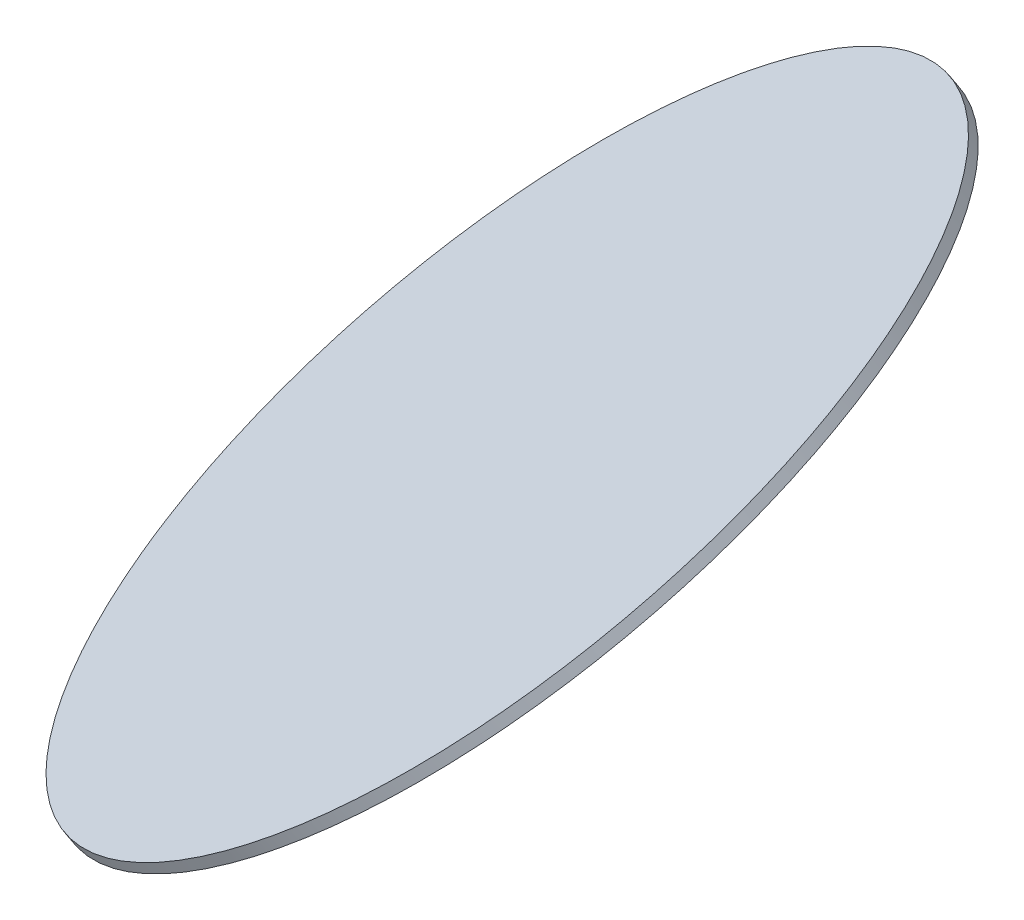
ISO-10303-21;
HEADER;
FILE_DESCRIPTION(('STEP AP214'),'2;1');
FILE_NAME('part.step','',(''),(''),'','','');
FILE_SCHEMA(('AUTOMOTIVE_DESIGN { 1 0 10303 214 1 1 1 1 }'));
ENDSEC;
DATA;
#1=APPLICATION_CONTEXT('core data for automotive mechanical design processes');
#2=APPLICATION_PROTOCOL_DEFINITION('international standard','automotive_design',2000,#1);
#3=PRODUCT_CONTEXT('',#1,'mechanical');
#4=PRODUCT('Part','Part','',(#3));
#5=PRODUCT_RELATED_PRODUCT_CATEGORY('part','',(#4));
#6=PRODUCT_DEFINITION_FORMATION('','',#4);
#7=PRODUCT_DEFINITION_CONTEXT('part definition',#1,'design');
#8=PRODUCT_DEFINITION('design','',#6,#7);
#9=PRODUCT_DEFINITION_SHAPE('','',#8);
#10=(LENGTH_UNIT() NAMED_UNIT(*) SI_UNIT(.MILLI.,.METRE.));
#11=(NAMED_UNIT(*) PLANE_ANGLE_UNIT() SI_UNIT($,.RADIAN.));
#12=(NAMED_UNIT(*) SI_UNIT($,.STERADIAN.) SOLID_ANGLE_UNIT());
#13=UNCERTAINTY_MEASURE_WITH_UNIT(LENGTH_MEASURE(1.E-05),#10,'distance_accuracy_value','');
#14=(GEOMETRIC_REPRESENTATION_CONTEXT(3) GLOBAL_UNCERTAINTY_ASSIGNED_CONTEXT((#13)) GLOBAL_UNIT_ASSIGNED_CONTEXT((#10,
#11,#12)) REPRESENTATION_CONTEXT('',''));
#15=CARTESIAN_POINT('',(0.,0.,0.));
#16=DIRECTION('',(0.,0.,1.));
#17=DIRECTION('',(1.,0.,0.));
#18=AXIS2_PLACEMENT_3D('',#15,#16,#17);
#19=CARTESIAN_POINT('',(-421.834970696077,260.326829567826,319.301786028271));
#20=CARTESIAN_POINT('',(-423.425436477836,262.704158960366,311.390337922479));
#21=CARTESIAN_POINT('',(-425.919363900651,267.918432883821,295.567441710896));
#22=CARTESIAN_POINT('',(-427.563215786157,277.043364721689,272.061672103809));
#23=CARTESIAN_POINT('',(-427.094197230668,287.383939430452,249.010850617888));
#24=CARTESIAN_POINT('',(-424.516825139266,298.840571622928,226.636969264903));
#25=CARTESIAN_POINT('',(-419.855921014126,311.302927668273,205.15550075309));
#26=CARTESIAN_POINT('',(-413.156371909882,324.650988265153,184.773323367185));
#27=CARTESIAN_POINT('',(-404.482698146754,338.756204293228,165.686728617444));
#28=CARTESIAN_POINT('',(-393.918431944594,353.482734811453,148.079530845101));
#29=CARTESIAN_POINT('',(-381.565312961943,368.688755280595,132.121296989779));
#30=CARTESIAN_POINT('',(-367.542308487507,384.227823411082,117.96571356716));
#31=CARTESIAN_POINT('',(-351.984467720128,399.950289482298,105.749106583835));
#32=CARTESIAN_POINT('',(-335.041621171177,415.704737551203,95.5891286433293));
#33=CARTESIAN_POINT('',(-316.876937714822,431.339443670635,87.5836258872187));
#34=CARTESIAN_POINT('',(-297.665353182574,446.703837073865,81.809695683298));
#35=CARTESIAN_POINT('',(-277.591885635599,461.649950253389,78.3229441357821));
#36=CARTESIAN_POINT('',(-256.849853539648,476.03384396891,77.1569505681254));
#37=CARTESIAN_POINT('',(-235.639014002554,489.716993460912,78.3229441357819));
#38=CARTESIAN_POINT('',(-214.163639004081,502.567622519817,81.809695683298));
#39=CARTESIAN_POINT('',(-192.630548145101,514.461972562919,87.5836258872188));
#40=CARTESIAN_POINT('',(-171.24711686177,525.28549449719,95.5891286433292));
#41=CARTESIAN_POINT('',(-150.219279286719,534.933951889664,105.749106583835));
#42=CARTESIAN_POINT('',(-129.749544990781,543.314424821267,117.96571356716));
#43=CARTESIAN_POINT('',(-110.035048705121,550.346204756438,132.121296989779));
#44=CARTESIAN_POINT('',(-91.2656518060091,555.961571810436,148.079530845101));
#45=CARTESIAN_POINT('',(-73.6221138459808,560.106446928862,165.686728617444));
#46=CARTESIAN_POINT('',(-57.2743517405296,562.740912698504,184.773323367185));
#47=CARTESIAN_POINT('',(-42.3798033753273,563.839597773857,205.15550075309));
#48=CARTESIAN_POINT('',(-29.0819113933184,563.391921217041,226.636969264903));
#49=CARTESIAN_POINT('',(-17.5087417636575,561.402194398024,249.010850617888));
#50=CARTESIAN_POINT('',(-7.77175043641579,557.889579473768,272.061672103809));
#51=CARTESIAN_POINT('',(0.0352900391439792,552.887904846185,295.567441710896));
#52=CARTESIAN_POINT('',(5.83719359548026,546.445339376132,319.301786028271));
#53=CARTESIAN_POINT('',(9.57808472970202,538.62392849095,343.036130345647));
#54=CARTESIAN_POINT('',(11.2219366152078,529.498996653081,366.541899952733));
#55=CARTESIAN_POINT('',(10.7529180597191,519.158421944318,389.592721438654));
#56=CARTESIAN_POINT('',(8.17554596831734,507.701789751843,411.966602791639));
#57=CARTESIAN_POINT('',(3.51464184317708,495.239433706497,433.448071303452));
#58=CARTESIAN_POINT('',(-3.18490726106665,481.891373109617,453.830248689357));
#59=CARTESIAN_POINT('',(-11.8585810241946,467.786157081542,472.916843439099));
#60=CARTESIAN_POINT('',(-22.4228472263545,453.059626563318,490.524041211441));
#61=CARTESIAN_POINT('',(-34.7759662090054,437.853606094175,506.482275066764));
#62=CARTESIAN_POINT('',(-48.7989706834416,422.314537963688,520.637858489382));
#63=CARTESIAN_POINT('',(-64.3568114508207,406.592071892472,532.854465472707));
#64=CARTESIAN_POINT('',(-81.2996579997718,390.837623823568,543.014443413213));
#65=CARTESIAN_POINT('',(-99.4643414561268,375.202917704135,551.019946169323));
#66=CARTESIAN_POINT('',(-118.675925988375,359.838524300905,556.793876373244));
#67=CARTESIAN_POINT('',(-138.74939353535,344.892411121382,560.28062792076));
#68=CARTESIAN_POINT('',(-159.4914256313,330.508517405861,561.446621488417));
#69=CARTESIAN_POINT('',(-180.702265168395,316.825367913858,560.28062792076));
#70=CARTESIAN_POINT('',(-202.177640166867,303.974738854953,556.793876373244));
#71=CARTESIAN_POINT('',(-223.710731025847,292.080388811851,551.019946169323));
#72=CARTESIAN_POINT('',(-245.094162309179,281.25686687758,543.014443413213));
#73=CARTESIAN_POINT('',(-266.12199988423,271.608409485107,532.854465472707));
#74=CARTESIAN_POINT('',(-286.591734180168,263.227936553503,520.637858489382));
#75=CARTESIAN_POINT('',(-306.306230465828,256.196156618333,506.482275066764));
#76=CARTESIAN_POINT('',(-325.07562736494,250.580789564334,490.524041211441));
#77=CARTESIAN_POINT('',(-342.719165324968,246.435914445909,472.916843439099));
#78=CARTESIAN_POINT('',(-359.066927430419,243.801448676266,453.830248689357));
#79=CARTESIAN_POINT('',(-373.961475795621,242.702763600914,433.448071303452));
#80=CARTESIAN_POINT('',(-387.25936777763,243.15044015773,411.96660279164));
#81=CARTESIAN_POINT('',(-398.832537407291,245.140166976747,389.592721438655));
#82=CARTESIAN_POINT('',(-408.569528734533,248.652781901002,366.541899952733));
#83=CARTESIAN_POINT('',(-416.376569210093,253.654456528585,343.036130345647));
#84=CARTESIAN_POINT('',(-420.244504914317,257.949500175287,327.213234134063));
#85=CARTESIAN_POINT('',(-421.834970696077,260.326829567826,319.301786028271));
#86=B_SPLINE_CURVE_WITH_KNOTS('',3,(#19,#20,#21,#22,#23,#24,#25,#26,#27,#28,#29,#30,#31,#32,#33,
#34,#35,#36,#37,#38,#39,#40,#41,#42,#43,#44,#45,#46,#47,#48,#49,#50,#51,#52,#53,#54,#55,#56,#57,
#58,#59,#60,#61,#62,#63,#64,#65,#66,#67,#68,#69,#70,#71,#72,#73,#74,#75,#76,#77,#78,#79,#80,#81,
#82,#83,#84,#85),.UNSPECIFIED.,.T.,.F.,(4,1,1,1,1,1,1,1,1,1,1,1,1,1,1,1,1,1,1,1,1,1,1,1,1,1,1,1,
1,1,1,1,1,1,1,1,1,1,1,1,1,1,1,1,1,1,1,1,1,1,1,1,1,1,1,1,1,1,1,1,1,1,1,1,4),(0.,0.015625,0.03125,
0.046875,0.0625,0.078125,0.09375,0.109375,0.125,0.140625,0.15625,0.171875,0.1875,0.203125,
0.21875,0.234375,0.25,0.265625,0.28125,0.296875,0.3125,0.328125,0.34375,0.359375,0.375,0.390625,
0.40625,0.421875,0.4375,0.453125,0.46875,0.484375,0.5,0.515625,0.53125,0.546875,0.5625,0.578125,
0.59375,0.609375,0.625,0.640625,0.65625,0.671875,0.6875,0.703125,0.71875,0.734375,0.75,0.765625,
0.78125,0.796875,0.8125,0.828125,0.84375,0.859375,0.875,0.890625,0.90625,0.921875,0.9375,
0.953125,0.96875,0.984375,1.),.UNSPECIFIED.);
#87=DIRECTION('',(-0.522923504454294,0.781633551281699,0.34));
#88=VECTOR('',#87,1.);
#89=SURFACE_OF_LINEAR_EXTRUSION('',#86,#88);
#90=CARTESIAN_POINT('',(-421.834970696077,260.326829567826,319.301786028271));
#91=CARTESIAN_POINT('',(-421.039737805197,259.138164871557,323.257510081167));
#92=CARTESIAN_POINT('',(-420.158629396729,258.006952067584,327.213234134063));
#93=CARTESIAN_POINT('',(-418.22698969057,255.862015470372,335.115158293593));
#94=CARTESIAN_POINT('',(-417.17645839288,254.848291677133,339.061358400227));
#95=CARTESIAN_POINT('',(-414.908301054231,252.940918327527,346.934710720971));
#96=CARTESIAN_POINT('',(-413.690675013272,252.04726877116,350.86186293508));
#97=CARTESIAN_POINT('',(-411.091460940899,250.382050931168,358.687687245323));
#98=CARTESIAN_POINT('',(-409.709872909486,249.610482647543,362.586359341455));
#99=CARTESIAN_POINT('',(-406.785867609019,248.191434388903,370.34579119029));
#100=CARTESIAN_POINT('',(-405.243450339966,247.543954413889,374.206550942992));
#101=CARTESIAN_POINT('',(-402.001693753771,246.374492289217,381.880908437809));
#102=CARTESIAN_POINT('',(-400.30235443663,245.852510139559,385.694506179923));
#103=CARTESIAN_POINT('',(-396.750660943813,244.935453182347,393.265289986408));
#104=CARTESIAN_POINT('',(-394.898306768137,244.540378374793,397.022476050778));
#105=CARTESIAN_POINT('',(-391.045227556169,243.877934524994,404.471458472263));
#106=CARTESIAN_POINT('',(-389.044502519878,243.610565482749,408.163254829378));
#107=CARTESIAN_POINT('',(-384.8993255846,243.204331586777,415.472479806844));
#108=CARTESIAN_POINT('',(-382.754873685613,243.065466733049,419.089908427195));
#109=CARTESIAN_POINT('',(-378.327579106991,242.916420854526,426.241778002602));
#110=CARTESIAN_POINT('',(-376.044736427357,242.90623982973,429.776218957658));
#111=CARTESIAN_POINT('',(-371.345996369488,243.014741249487,436.753493273944));
#112=CARTESIAN_POINT('',(-368.930098991254,243.133423694038,440.196326635175));
#113=CARTESIAN_POINT('',(-363.971226312976,243.499211180077,446.982206950882));
#114=CARTESIAN_POINT('',(-361.428251012932,243.746316221565,450.32525390536));
#115=CARTESIAN_POINT('',(-356.221199267823,244.368508029064,456.903382594634));
#116=CARTESIAN_POINT('',(-353.557122822758,244.743594795076,460.138464329431));
#117=CARTESIAN_POINT('',(-348.114428699511,245.620692912227,466.49300364846));
#118=CARTESIAN_POINT('',(-345.335811021328,246.122704263367,469.612461232692));
#119=CARTESIAN_POINT('',(-339.670594343748,247.252594411378,475.728093319706));
#120=CARTESIAN_POINT('',(-336.783995344351,247.88047320825,478.724267822488));
#121=CARTESIAN_POINT('',(-330.90989589582,249.260435022174,484.586268457451));
#122=CARTESIAN_POINT('',(-327.922395446687,250.012518039227,487.452094589632));
#123=CARTESIAN_POINT('',(-321.853572970164,251.639225067965,493.046333194243));
#124=CARTESIAN_POINT('',(-318.772250942774,252.513849079649,495.774745666673));
#125=CARTESIAN_POINT('',(-312.523316957759,254.383384803715,501.08775334696));
#126=CARTESIAN_POINT('',(-309.355705000134,255.378296516097,503.672348554818));
#127=CARTESIAN_POINT('',(-302.941722802672,257.486154347625,508.691318101142));
#128=CARTESIAN_POINT('',(-299.695352562835,258.599100466771,511.125692439607));
#129=CARTESIAN_POINT('',(-293.131764691626,260.940205449964,515.838539996872));
#130=CARTESIAN_POINT('',(-289.814547060255,262.16836431401,518.117013215671));
#131=CARTESIAN_POINT('',(-283.117175296655,264.737073125139,522.512378283329));
#132=CARTESIAN_POINT('',(-279.737021164427,266.077623072222,524.629270132187));
#133=CARTESIAN_POINT('',(-272.921990346246,268.867751193775,528.696570268148));
#134=CARTESIAN_POINT('',(-269.487113660293,270.317329368245,530.646978555252));
#135=CARTESIAN_POINT('',(-262.570851681795,273.322151088925,534.37640937589));
#136=CARTESIAN_POINT('',(-259.089466389249,274.877394635134,536.155431909425));
#137=CARTESIAN_POINT('',(-252.08862509635,278.089675435997,539.538014300362));
#138=CARTESIAN_POINT('',(-248.569169095997,279.746712690651,541.141574157763));
#139=CARTESIAN_POINT('',(-241.500624286266,283.158709245109,544.169154273865));
#140=CARTESIAN_POINT('',(-237.95153547689,284.913668544912,545.593174532567));
#141=CARTESIAN_POINT('',(-230.832305637972,288.517166004962,548.258463060945));
#142=CARTESIAN_POINT('',(-227.262164608432,290.365704165209,549.499731330623));
#143=CARTESIAN_POINT('',(-220.109410918046,294.152016161438,551.796303490628));
#144=CARTESIAN_POINT('',(-216.526798257202,296.08978999742,552.851607380956));
#145=CARTESIAN_POINT('',(-209.357741947382,300.049800466245,554.773933861254));
#146=CARTESIAN_POINT('',(-205.771298298406,302.072037099087,555.640956451224));
#147=CARTESIAN_POINT('',(-198.603220655497,306.196200282754,557.184403409797));
#148=CARTESIAN_POINT('',(-195.021586661564,308.29812683358,557.8608277784));
#149=CARTESIAN_POINT('',(-187.87174581211,312.576513245602,559.021679155761));
#150=CARTESIAN_POINT('',(-184.303538956589,314.752973106799,559.506106164519));
#151=CARTESIAN_POINT('',(-177.189169867327,319.17526953195,560.281563683715));
#152=CARTESIAN_POINT('',(-173.643007633588,321.421106095905,560.572594194152));
#153=CARTESIAN_POINT('',(-166.58123912038,325.976665251173,560.960790835227));
#154=CARTESIAN_POINT('',(-163.065632840911,328.286387842487,561.057956965865));
#155=CARTESIAN_POINT('',(-156.073487568737,332.964228377074,561.057956965865));
#156=CARTESIAN_POINT('',(-152.596948576031,335.332346320348,560.960790835227));
#157=CARTESIAN_POINT('',(-145.691261090207,340.121205693875,560.572594194152));
#158=CARTESIAN_POINT('',(-142.262112597089,342.541947124129,560.281563683715));
#159=CARTESIAN_POINT('',(-135.459529323268,347.430281606636,559.506106164519));
#160=CARTESIAN_POINT('',(-132.086094542565,349.89787465889,559.021679155761));
#161=CARTESIAN_POINT('',(-125.402993629647,354.873914917052,557.860827778399));
#162=CARTESIAN_POINT('',(-122.093327497431,357.38236212296,557.184403409797));
#163=CARTESIAN_POINT('',(-115.545818817561,362.434113220086,555.640956451224));
#164=CARTESIAN_POINT('',(-112.307976269906,364.977417111303,554.773933861254));
#165=CARTESIAN_POINT('',(-105.911823845038,370.092716266234,552.851607380956));
#166=CARTESIAN_POINT('',(-102.753513967826,372.664711529947,551.796303490628));
#167=CARTESIAN_POINT('',(-96.5241359697254,377.831228117058,549.499731330623));
#168=CARTESIAN_POINT('',(-93.4530678488373,380.425749440455,548.258463060945));
#169=CARTESIAN_POINT('',(-87.4054623563653,385.631044364985,545.593174532567));
#170=CARTESIAN_POINT('',(-84.4289249847813,388.241817966118,544.169154273865));
#171=CARTESIAN_POINT('',(-78.5776699838969,393.473343664175,541.141574157762));
#172=CARTESIAN_POINT('',(-75.7029523545966,396.094095761097,539.538014300361));
#173=CARTESIAN_POINT('',(-70.0621355413699,401.3392566196,536.155431909425));
#174=CARTESIAN_POINT('',(-67.2960363574435,403.963665381181,534.37640937589));
#175=CARTESIAN_POINT('',(-61.8792551380551,409.209817737868,530.646978555252));
#176=CARTESIAN_POINT('',(-59.2285731025931,411.831561332974,528.696570268148));
#177=CARTESIAN_POINT('',(-54.0488691181072,417.066074359086,524.629270132187));
#178=CARTESIAN_POINT('',(-51.5198471690833,419.678843790091,522.512378283329));
#179=CARTESIAN_POINT('',(-46.5897062954475,424.889099490375,518.117013215671));
#180=CARTESIAN_POINT('',(-44.1885873708355,427.486585759653,515.838539996872));
#181=CARTESIAN_POINT('',(-39.5198795959752,432.660039731456,511.125692439607));
#182=CARTESIAN_POINT('',(-37.2522907457269,435.236007433982,508.691318101142));
#183=CARTESIAN_POINT('',(-32.8562701695457,440.360188867253,503.672348554818));
#184=CARTESIAN_POINT('',(-30.7278384436128,442.908402598,501.08775334696));
#185=CARTESIAN_POINT('',(-26.6150890864253,447.970974325648,495.774745666673));
#186=CARTESIAN_POINT('',(-24.6307714551706,450.485332322551,493.046333194243));
#187=CARTESIAN_POINT('',(-20.8112072577022,455.474090820445,487.452094589632));
#188=CARTESIAN_POINT('',(-18.9759606914884,457.948491321437,484.586268457451));
#189=CARTESIAN_POINT('',(-15.4587777765409,462.851425471711,478.724267822488));
#190=CARTESIAN_POINT('',(-13.7768414278073,465.279959120992,475.728093319706));
#191=CARTESIAN_POINT('',(-10.5705181002593,470.085250212042,469.612461232692));
#192=CARTESIAN_POINT('',(-9.04613112144497,472.462007653811,466.49300364846));
#193=CARTESIAN_POINT('',(-6.15838704289617,477.158086290626,460.138464329431));
#194=CARTESIAN_POINT('',(-4.79502994316169,479.477407485672,456.903382594634));
#195=CARTESIAN_POINT('',(-2.23282613193307,484.052953589831,450.32525390536));
#196=CARTESIAN_POINT('',(-1.03397942043894,486.309178498944,446.982206950882));
#197=CARTESIAN_POINT('',(1.19651526763318,490.75317581789,440.196326635175));
#198=CARTESIAN_POINT('',(2.22816324421117,492.940948227723,436.753493273944));
#199=CARTESIAN_POINT('',(4.12157211577517,497.24268433476,429.776218957658));
#200=CARTESIAN_POINT('',(4.98333301076119,499.356648031965,426.241778002602));
#201=CARTESIAN_POINT('',(6.53509742519815,503.505765909525,419.089908427195));
#202=CARTESIAN_POINT('',(7.22510094464909,505.540920089879,415.472479806844));
#203=CARTESIAN_POINT('',(8.43148031407278,509.527418129516,408.163254829378));
#204=CARTESIAN_POINT('',(8.94785616404551,511.478761988798,404.471458472262));
#205=CARTESIAN_POINT('',(9.80594596525551,515.293042151672,397.022476050777));
#206=CARTESIAN_POINT('',(10.1476599164928,517.155978455263,393.265289986407));
#207=CARTESIAN_POINT('',(10.6553916909745,520.788846272136,385.694506179923));
#208=CARTESIAN_POINT('',(10.821409514219,522.558777785418,381.880908437808));
#209=CARTESIAN_POINT('',(10.9775608283368,526.001486630539,374.206550942992));
#210=CARTESIAN_POINT('',(10.9676943192102,527.674263962379,370.34579119029));
#211=CARTESIAN_POINT('',(10.7718887642073,530.918515053484,362.586359341455));
#212=CARTESIAN_POINT('',(10.5859497183311,532.48998881275,358.687687245323));
#213=CARTESIAN_POINT('',(10.0386587228408,535.527971171965,350.86186293508));
#214=CARTESIAN_POINT('',(9.67730677322669,536.994479771914,346.93471072097));
#215=CARTESIAN_POINT('',(8.7798496032721,539.818870225756,339.061358400227));
#216=CARTESIAN_POINT('',(8.24374438293164,541.176752079648,335.115158293593));
#217=CARTESIAN_POINT('',(6.99828178929946,543.780750522107,327.213234134063));
#218=CARTESIAN_POINT('',(6.28892441600774,545.026867110674,323.257510081167));
#219=CARTESIAN_POINT('',(4.69845863424807,547.404196503214,315.346061975375));
#220=CARTESIAN_POINT('',(3.81735022578012,548.535409307186,311.390337922479));
#221=CARTESIAN_POINT('',(1.88571051962182,550.680345904398,303.48841376295));
#222=CARTESIAN_POINT('',(0.835179221931471,551.694069697637,299.542213656316));
#223=CARTESIAN_POINT('',(-1.43297811671787,553.601443047243,291.668861335572));
#224=CARTESIAN_POINT('',(-2.65060415767685,554.49509260361,287.741709121462));
#225=CARTESIAN_POINT('',(-5.24981823004922,556.160310443602,279.91588481122));
#226=CARTESIAN_POINT('',(-6.6314062614626,556.931878727227,276.017212715087));
#227=CARTESIAN_POINT('',(-9.55541156192951,558.350926985867,268.257780866253));
#228=CARTESIAN_POINT('',(-11.097828830983,558.998406960881,264.397021113551));
#229=CARTESIAN_POINT('',(-14.3395854171777,560.167869085554,256.722663618734));
#230=CARTESIAN_POINT('',(-16.0389247343187,560.689851235211,252.909065876619));
#231=CARTESIAN_POINT('',(-19.5906182271358,561.606908192423,245.338282070135));
#232=CARTESIAN_POINT('',(-21.4429724028119,562.001982999978,241.581096005765));
#233=CARTESIAN_POINT('',(-25.2960516147792,562.664426849777,234.13211358428));
#234=CARTESIAN_POINT('',(-27.2967766510705,562.931795892021,230.440317227165));
#235=CARTESIAN_POINT('',(-31.4419535863488,563.338029787993,223.131092249698));
#236=CARTESIAN_POINT('',(-33.5864054853358,563.476894641721,219.513663629347));
#237=CARTESIAN_POINT('',(-38.0137000639573,563.625940520244,212.361794053941));
#238=CARTESIAN_POINT('',(-40.2965427435919,563.63612154504,208.827353098885));
#239=CARTESIAN_POINT('',(-44.9952828014604,563.527620125284,201.850078782598));
#240=CARTESIAN_POINT('',(-47.4111801796944,563.408937680732,198.407245421368));
#241=CARTESIAN_POINT('',(-52.3700528579725,563.043150194693,191.62136510566));
#242=CARTESIAN_POINT('',(-54.9130281580166,562.796045153205,188.278318151183));
#243=CARTESIAN_POINT('',(-60.1200799031255,562.173853345706,181.700189461908));
#244=CARTESIAN_POINT('',(-62.7841563481903,561.798766579695,178.465107727111));
#245=CARTESIAN_POINT('',(-68.2268504714377,560.921668462543,172.110568408082));
#246=CARTESIAN_POINT('',(-71.0054681496203,560.419657111403,168.99111082385));
#247=CARTESIAN_POINT('',(-76.6706848272002,559.289766963392,162.875478736837));
#248=CARTESIAN_POINT('',(-79.5572838265975,558.661888166521,159.879304234055));
#249=CARTESIAN_POINT('',(-85.4313832751281,557.281926352596,154.017303599091));
#250=CARTESIAN_POINT('',(-88.4188837242613,556.529843335543,151.15147746691));
#251=CARTESIAN_POINT('',(-94.4877062007846,554.903136306806,145.557238862299));
#252=CARTESIAN_POINT('',(-97.5690282281747,554.028512295121,142.82882638987));
#253=CARTESIAN_POINT('',(-103.81796221319,552.158976571055,137.515818709582));
#254=CARTESIAN_POINT('',(-106.985574170814,551.164064858673,134.931223501724));
#255=CARTESIAN_POINT('',(-113.399556368276,549.056207027145,129.912253955401));
#256=CARTESIAN_POINT('',(-116.645926608114,547.943260907999,127.477879616935));
#257=CARTESIAN_POINT('',(-123.209514479322,545.602155924806,122.76503205967));
#258=CARTESIAN_POINT('',(-126.526732110694,544.37399706076,120.486558840871));
#259=CARTESIAN_POINT('',(-133.224103874294,541.805288249631,116.091193773214));
#260=CARTESIAN_POINT('',(-136.604258006522,540.464738302548,113.974301924356));
#261=CARTESIAN_POINT('',(-143.419288824703,537.674610180995,109.907001788394));
#262=CARTESIAN_POINT('',(-146.854165510655,536.225032006525,107.956593501291));
#263=CARTESIAN_POINT('',(-153.770427489154,533.220210285846,104.227162680652));
#264=CARTESIAN_POINT('',(-157.251812781699,531.664966739636,102.448140147117));
#265=CARTESIAN_POINT('',(-164.252654074598,528.452685938773,99.065557756181));
#266=CARTESIAN_POINT('',(-167.772110074952,526.795648684119,97.4619978987798));
#267=CARTESIAN_POINT('',(-174.840654884682,523.383652129662,94.4344177826771));
#268=CARTESIAN_POINT('',(-178.389743694059,521.628692829858,93.0103975239756));
#269=CARTESIAN_POINT('',(-185.508973532976,518.025195369808,90.3451089955968));
#270=CARTESIAN_POINT('',(-189.079114562517,516.176657209562,89.1038407259197));
#271=CARTESIAN_POINT('',(-196.231868252902,512.390345213333,86.8072685659144));
#272=CARTESIAN_POINT('',(-199.814480913747,510.45257137735,85.7519646755864));
#273=CARTESIAN_POINT('',(-206.983537223567,506.492560908526,83.8296381952885));
#274=CARTESIAN_POINT('',(-210.569980872542,504.470324275684,82.9626156053185));
#275=CARTESIAN_POINT('',(-217.738058515451,500.346161092016,81.4191686467457));
#276=CARTESIAN_POINT('',(-221.319692509384,498.24423454119,80.7427442781428));
#277=CARTESIAN_POINT('',(-228.469533358839,493.965848129168,79.5818929007814));
#278=CARTESIAN_POINT('',(-232.03774021436,491.789388267971,79.0974658920229));
#279=CARTESIAN_POINT('',(-239.152109303621,487.36709184282,78.3220083728274));
#280=CARTESIAN_POINT('',(-242.698271537361,485.121255278865,78.0309778623905));
#281=CARTESIAN_POINT('',(-249.760040050569,480.565696123597,77.6427812213156));
#282=CARTESIAN_POINT('',(-253.275646330037,478.255973532283,77.5456150906775));
#283=CARTESIAN_POINT('',(-260.267791602211,473.578132997696,77.5456150906776));
#284=CARTESIAN_POINT('',(-263.744330594918,471.210015054423,77.6427812213156));
#285=CARTESIAN_POINT('',(-270.650018080742,466.421155680895,78.0309778623906));
#286=CARTESIAN_POINT('',(-274.079166573859,464.000414250642,78.3220083728275));
#287=CARTESIAN_POINT('',(-280.88174984768,459.112079768134,79.097465892023));
#288=CARTESIAN_POINT('',(-284.255184628384,456.644486715881,79.5818929007815));
#289=CARTESIAN_POINT('',(-290.938285541302,451.668446457718,80.7427442781429));
#290=CARTESIAN_POINT('',(-294.247951673518,449.15999925181,81.4191686467457));
#291=CARTESIAN_POINT('',(-300.795460353388,444.108248154684,82.9626156053185));
#292=CARTESIAN_POINT('',(-304.033302901043,441.564944263467,83.8296381952884));
#293=CARTESIAN_POINT('',(-310.42945532591,436.449645108536,85.7519646755864));
#294=CARTESIAN_POINT('',(-313.587765203123,433.877649844823,86.8072685659144));
#295=CARTESIAN_POINT('',(-319.817143201223,428.711133257713,89.1038407259196));
#296=CARTESIAN_POINT('',(-322.888211322111,426.116611934316,90.3451089955968));
#297=CARTESIAN_POINT('',(-328.935816814583,420.911317009785,93.0103975239756));
#298=CARTESIAN_POINT('',(-331.912354186167,418.300543408652,94.4344177826771));
#299=CARTESIAN_POINT('',(-337.763609187052,413.069017710596,97.4619978987798));
#300=CARTESIAN_POINT('',(-340.638326816352,410.448265613673,99.065557756181));
#301=CARTESIAN_POINT('',(-346.279143629579,405.20310475517,102.448140147117));
#302=CARTESIAN_POINT('',(-349.045242813505,402.578695993589,104.227162680652));
#303=CARTESIAN_POINT('',(-354.462024032893,397.332543636903,107.956593501291));
#304=CARTESIAN_POINT('',(-357.112706068356,394.710800041796,109.907001788394));
#305=CARTESIAN_POINT('',(-362.292410052841,389.476287015685,113.974301924356));
#306=CARTESIAN_POINT('',(-364.821432001865,386.863517584679,116.091193773214));
#307=CARTESIAN_POINT('',(-369.751572875501,381.653261884395,120.486558840871));
#308=CARTESIAN_POINT('',(-372.152691800113,379.055775615117,122.76503205967));
#309=CARTESIAN_POINT('',(-376.821399574974,373.882321643314,127.477879616935));
#310=CARTESIAN_POINT('',(-379.088988425222,371.306353940788,129.912253955401));
#311=CARTESIAN_POINT('',(-383.485009001403,366.182172507517,134.931223501724));
#312=CARTESIAN_POINT('',(-385.613440727336,363.63395877677,137.515818709582));
#313=CARTESIAN_POINT('',(-389.726190084523,358.571387049122,142.82882638987));
#314=CARTESIAN_POINT('',(-391.710507715778,356.05702905222,145.557238862299));
#315=CARTESIAN_POINT('',(-395.530071913247,351.068270554325,151.15147746691));
#316=CARTESIAN_POINT('',(-397.36531847946,348.593870053333,154.017303599091));
#317=CARTESIAN_POINT('',(-400.882501394408,343.690935903059,159.879304234055));
#318=CARTESIAN_POINT('',(-402.564437743142,341.262402253778,162.875478736837));
#319=CARTESIAN_POINT('',(-405.77076107069,336.457111162728,168.99111082385));
#320=CARTESIAN_POINT('',(-407.295148049504,334.080353720959,172.110568408082));
#321=CARTESIAN_POINT('',(-410.182892128053,329.384275084144,178.465107727111));
#322=CARTESIAN_POINT('',(-411.546249227787,327.064953889098,181.700189461908));
#323=CARTESIAN_POINT('',(-414.108453039016,322.489407784939,188.278318151183));
#324=CARTESIAN_POINT('',(-415.30729975051,320.233182875826,191.62136510566));
#325=CARTESIAN_POINT('',(-417.537794438582,315.78918555688,198.407245421368));
#326=CARTESIAN_POINT('',(-418.56944241516,313.601413147047,201.850078782598));
#327=CARTESIAN_POINT('',(-420.462851286724,309.29967704001,208.827353098885));
#328=CARTESIAN_POINT('',(-421.32461218171,307.185713342805,212.361794053941));
#329=CARTESIAN_POINT('',(-422.876376596147,303.036595465246,219.513663629347));
#330=CARTESIAN_POINT('',(-423.566380115598,301.001441284891,223.131092249698));
#331=CARTESIAN_POINT('',(-424.772759485021,297.014943245254,230.440317227165));
#332=CARTESIAN_POINT('',(-425.289135334994,295.063599385972,234.13211358428));
#333=CARTESIAN_POINT('',(-426.147225136204,291.249319223098,241.581096005765));
#334=CARTESIAN_POINT('',(-426.488939087441,289.386382919507,245.338282070135));
#335=CARTESIAN_POINT('',(-426.996670861923,285.753515102634,252.909065876619));
#336=CARTESIAN_POINT('',(-427.162688685168,283.983583589352,256.722663618734));
#337=CARTESIAN_POINT('',(-427.318839999285,280.540874744231,264.39702111355));
#338=CARTESIAN_POINT('',(-427.308973490159,278.868097412391,268.257780866252));
#339=CARTESIAN_POINT('',(-427.113167935156,275.623846321286,276.017212715087));
#340=CARTESIAN_POINT('',(-426.92722888928,274.05237256202,279.91588481122));
#341=CARTESIAN_POINT('',(-426.37993789379,271.014390202806,287.741709121462));
#342=CARTESIAN_POINT('',(-426.018585944175,269.547881602856,291.668861335572));
#343=CARTESIAN_POINT('',(-425.121128774221,266.723491149014,299.542213656316));
#344=CARTESIAN_POINT('',(-424.58502355388,265.365609295122,303.48841376295));
#345=CARTESIAN_POINT('',(-423.339560960248,262.761610852663,311.390337922479));
#346=CARTESIAN_POINT('',(-422.630203586956,261.515494264096,315.346061975375));
#347=CARTESIAN_POINT('',(-421.834970696077,260.326829567826,319.301786028271));
#348=B_SPLINE_CURVE_WITH_KNOTS('',3,(#90,#91,#92,#93,#94,#95,#96,#97,#98,#99,#100,#101,#102,
#103,#104,#105,#106,#107,#108,#109,#110,#111,#112,#113,#114,#115,#116,#117,#118,#119,#120,#121,
#122,#123,#124,#125,#126,#127,#128,#129,#130,#131,#132,#133,#134,#135,#136,#137,#138,#139,#140,
#141,#142,#143,#144,#145,#146,#147,#148,#149,#150,#151,#152,#153,#154,#155,#156,#157,#158,#159,
#160,#161,#162,#163,#164,#165,#166,#167,#168,#169,#170,#171,#172,#173,#174,#175,#176,#177,#178,
#179,#180,#181,#182,#183,#184,#185,#186,#187,#188,#189,#190,#191,#192,#193,#194,#195,#196,#197,
#198,#199,#200,#201,#202,#203,#204,#205,#206,#207,#208,#209,#210,#211,#212,#213,#214,#215,#216,
#217,#218,#219,#220,#221,#222,#223,#224,#225,#226,#227,#228,#229,#230,#231,#232,#233,#234,#235,
#236,#237,#238,#239,#240,#241,#242,#243,#244,#245,#246,#247,#248,#249,#250,#251,#252,#253,#254,
#255,#256,#257,#258,#259,#260,#261,#262,#263,#264,#265,#266,#267,#268,#269,#270,#271,#272,#273,
#274,#275,#276,#277,#278,#279,#280,#281,#282,#283,#284,#285,#286,#287,#288,#289,#290,#291,#292,
#293,#294,#295,#296,#297,#298,#299,#300,#301,#302,#303,#304,#305,#306,#307,#308,#309,#310,#311,
#312,#313,#314,#315,#316,#317,#318,#319,#320,#321,#322,#323,#324,#325,#326,#327,#328,#329,#330,
#331,#332,#333,#334,#335,#336,#337,#338,#339,#340,#341,#342,#343,#344,#345,#346,#347),
.UNSPECIFIED.,.F.,.F.,(4,2,2,2,2,2,2,2,2,2,2,2,2,2,2,2,2,2,2,2,2,2,2,2,2,2,2,2,2,2,2,2,2,2,2,2,
2,2,2,2,2,2,2,2,2,2,2,2,2,2,2,2,2,2,2,2,2,2,2,2,2,2,2,2,2,2,2,2,2,2,2,2,2,2,2,2,2,2,2,2,2,2,2,2,
2,2,2,2,2,2,2,2,2,2,2,2,2,2,2,2,2,2,2,2,2,2,2,2,2,2,2,2,2,2,2,2,2,2,2,2,2,2,2,2,2,2,2,2,4),(0.,
12.6176781138512,25.2353562277024,37.8530343415535,50.4707124554045,63.0883905692555,
75.7060686831067,88.3237467969578,100.941424910809,113.55910302466,126.176781138511,
138.794459252362,151.412137366213,164.029815480064,176.647493593915,189.265171707766,
201.882849821617,214.500527935468,227.118206049319,239.73588416317,252.353562277021,
264.971240390872,277.588918504724,290.206596618575,302.824274732426,315.441952846277,
328.059630960128,340.677309073979,353.29498718783,365.912665301681,378.530343415532,
391.148021529383,403.765699643234,416.383377757085,429.001055870936,441.618733984787,
454.236412098638,466.854090212489,479.471768326341,492.089446440192,504.707124554043,
517.324802667894,529.942480781745,542.560158895596,555.177837009447,567.795515123298,
580.413193237149,593.030871351,605.648549464851,618.266227578702,630.883905692553,
643.501583806404,656.119261920255,668.736940034106,681.354618147957,693.972296261808,
706.589974375659,719.20765248951,731.825330603361,744.443008717212,757.060686831064,
769.678364944915,782.296043058766,794.913721172617,807.531399286468,820.149077400319,
832.76675551417,845.384433628021,858.002111741872,870.619789855723,883.237467969574,
895.855146083425,908.472824197276,921.090502311127,933.708180424978,946.325858538829,
958.94353665268,971.561214766531,984.178892880382,996.796570994234,1009.41424910808,
1022.03192722194,1034.64960533579,1047.26728344964,1059.88496156349,1072.50263967734,
1085.12031779119,1097.73799590504,1110.35567401889,1122.97335213274,1135.59103024659,
1148.20870836045,1160.8263864743,1173.44406458815,1186.061742702,1198.67942081585,
1211.2970989297,1223.91477704355,1236.5324551574,1249.15013327125,1261.76781138511,
1274.38548949896,1287.00316761281,1299.62084572666,1312.23852384051,1324.85620195436,
1337.47388006821,1350.09155818206,1362.70923629591,1375.32691440976,1387.94459252362,
1400.56227063747,1413.17994875132,1425.79762686517,1438.41530497902,1451.03298309287,
1463.65066120672,1476.26833932057,1488.88601743442,1501.50369554828,1514.12137366213,
1526.73905177598,1539.35672988983,1551.97440800368,1564.59208611753,1577.20976423138,
1589.82744234523,1602.44512045908,1615.06279857293),.UNSPECIFIED.);
#349=CARTESIAN_POINT('',(-421.834970696077,260.326829567826,319.301786028271));
#350=VERTEX_POINT('',#349);
#351=EDGE_CURVE('E9',#350,#350,#348,.F.);
#352=ORIENTED_EDGE('',*,*,#351,.F.);
#353=EDGE_LOOP('',(#352));
#354=FACE_BOUND('',#353,.T.);
#355=CARTESIAN_POINT('',(-425.488997997661,265.788642456115,321.677600601447));
#356=CARTESIAN_POINT('',(-427.07946377942,268.165971848654,313.766152495655));
#357=CARTESIAN_POINT('',(-429.573391202235,273.380245772109,297.943256284071));
#358=CARTESIAN_POINT('',(-431.21724308774,282.505177609978,274.437486676984));
#359=CARTESIAN_POINT('',(-430.748224532252,292.84575231874,251.386665191064));
#360=CARTESIAN_POINT('',(-428.17085244085,304.302384511216,229.012783838078));
#361=CARTESIAN_POINT('',(-423.50994831571,316.764740556561,207.531315326266));
#362=CARTESIAN_POINT('',(-416.810399211466,330.112801153441,187.14913794036));
#363=CARTESIAN_POINT('',(-408.136725448338,344.218017181517,168.062543190619));
#364=CARTESIAN_POINT('',(-397.572459246178,358.944547699741,150.455345418277));
#365=CARTESIAN_POINT('',(-385.219340263527,374.150568168884,134.497111562954));
#366=CARTESIAN_POINT('',(-371.196335789091,389.689636299371,120.341528140336));
#367=CARTESIAN_POINT('',(-355.638495021712,405.412102370586,108.124921157011));
#368=CARTESIAN_POINT('',(-338.695648472761,421.166550439491,97.9649432165049));
#369=CARTESIAN_POINT('',(-320.530965016406,436.801256558923,89.9594404603943));
#370=CARTESIAN_POINT('',(-301.319380484158,452.165649962153,84.1855102564736));
#371=CARTESIAN_POINT('',(-281.245912937183,467.111763141677,80.6987587089576));
#372=CARTESIAN_POINT('',(-260.503880841232,481.495656857198,79.5327651413009));
#373=CARTESIAN_POINT('',(-239.293041304138,495.1788063492,80.6987587089574));
#374=CARTESIAN_POINT('',(-217.817666305665,508.029435408105,84.1855102564736));
#375=CARTESIAN_POINT('',(-196.284575446685,519.923785451207,89.9594404603944));
#376=CARTESIAN_POINT('',(-174.901144163354,530.747307385478,97.9649432165048));
#377=CARTESIAN_POINT('',(-153.873306588303,540.395764777952,108.124921157011));
#378=CARTESIAN_POINT('',(-133.403572292365,548.776237709556,120.341528140336));
#379=CARTESIAN_POINT('',(-113.689076006705,555.808017644726,134.497111562954));
#380=CARTESIAN_POINT('',(-94.9196791075931,561.423384698725,150.455345418277));
#381=CARTESIAN_POINT('',(-77.2761411475648,565.56825981715,168.062543190619));
#382=CARTESIAN_POINT('',(-60.9283790421136,568.202725586793,187.14913794036));
#383=CARTESIAN_POINT('',(-46.0338306769113,569.301410662145,207.531315326266));
#384=CARTESIAN_POINT('',(-32.7359386949024,568.853734105329,229.012783838078));
#385=CARTESIAN_POINT('',(-21.1627690652415,566.864007286312,251.386665191063));
#386=CARTESIAN_POINT('',(-11.4257777379998,563.351392362057,274.437486676985));
#387=CARTESIAN_POINT('',(-3.61873726244001,558.349717734474,297.943256284071));
#388=CARTESIAN_POINT('',(2.18316629389628,551.907152264421,321.677600601447));
#389=CARTESIAN_POINT('',(5.92405742811804,544.085741379238,345.411944918822));
#390=CARTESIAN_POINT('',(7.56790931362382,534.960809541369,368.917714525909));
#391=CARTESIAN_POINT('',(7.09889075813516,524.620234832607,391.96853601183));
#392=CARTESIAN_POINT('',(4.52151866673335,513.163602640131,414.342417364815));
#393=CARTESIAN_POINT('',(-0.139385458406908,500.701246594786,435.823885876628));
#394=CARTESIAN_POINT('',(-6.83893456265063,487.353185997906,456.206063262533));
#395=CARTESIAN_POINT('',(-15.5126083257786,473.24796996983,475.292658012274));
#396=CARTESIAN_POINT('',(-26.0768745279385,458.521439451606,492.899855784616));
#397=CARTESIAN_POINT('',(-38.4299935105894,443.315418982463,508.85808963994));
#398=CARTESIAN_POINT('',(-52.4529979850256,427.776350851976,523.013673062558));
#399=CARTESIAN_POINT('',(-68.0108387524046,412.053884780761,535.230280045883));
#400=CARTESIAN_POINT('',(-84.9536853013557,396.299436711856,545.390257986389));
#401=CARTESIAN_POINT('',(-103.118368757711,380.664730592424,553.395760742499));
#402=CARTESIAN_POINT('',(-122.329953289959,365.300337189193,559.16969094642));
#403=CARTESIAN_POINT('',(-142.403420836934,350.35422400967,562.656442493936));
#404=CARTESIAN_POINT('',(-163.145452932884,335.970330294149,563.822436061593));
#405=CARTESIAN_POINT('',(-184.356292469979,322.287180802147,562.656442493936));
#406=CARTESIAN_POINT('',(-205.831667468451,309.436551743242,559.16969094642));
#407=CARTESIAN_POINT('',(-227.364758327431,297.54220170014,553.395760742499));
#408=CARTESIAN_POINT('',(-248.748189610763,286.718679765869,545.390257986389));
#409=CARTESIAN_POINT('',(-269.776027185814,277.070222373395,535.230280045883));
#410=CARTESIAN_POINT('',(-290.245761481752,268.689749441791,523.013673062558));
#411=CARTESIAN_POINT('',(-309.960257767412,261.657969506621,508.858089639939));
#412=CARTESIAN_POINT('',(-328.729654666524,256.042602452622,492.899855784617));
#413=CARTESIAN_POINT('',(-346.373192626552,251.897727334197,475.292658012274));
#414=CARTESIAN_POINT('',(-362.720954732003,249.263261564554,456.206063262533));
#415=CARTESIAN_POINT('',(-377.615503097205,248.164576489202,435.823885876628));
#416=CARTESIAN_POINT('',(-390.913395079214,248.612253046018,414.342417364816));
#417=CARTESIAN_POINT('',(-402.486564708875,250.601979865035,391.96853601183));
#418=CARTESIAN_POINT('',(-412.223556036117,254.11459478929,368.917714525909));
#419=CARTESIAN_POINT('',(-420.030596511677,259.116269416873,345.411944918822));
#420=CARTESIAN_POINT('',(-423.898532215901,263.411313063575,329.589048707239));
#421=CARTESIAN_POINT('',(-425.488997997661,265.788642456115,321.677600601447));
#422=B_SPLINE_CURVE_WITH_KNOTS('',3,(#355,#356,#357,#358,#359,#360,#361,#362,#363,#364,#365,
#366,#367,#368,#369,#370,#371,#372,#373,#374,#375,#376,#377,#378,#379,#380,#381,#382,#383,#384,
#385,#386,#387,#388,#389,#390,#391,#392,#393,#394,#395,#396,#397,#398,#399,#400,#401,#402,#403,
#404,#405,#406,#407,#408,#409,#410,#411,#412,#413,#414,#415,#416,#417,#418,#419,#420,#421),
.UNSPECIFIED.,.T.,.F.,(4,1,1,1,1,1,1,1,1,1,1,1,1,1,1,1,1,1,1,1,1,1,1,1,1,1,1,1,1,1,1,1,1,1,1,1,
1,1,1,1,1,1,1,1,1,1,1,1,1,1,1,1,1,1,1,1,1,1,1,1,1,1,1,1,4),(0.,0.015625,0.03125,0.046875,0.0625,
0.078125,0.09375,0.109375,0.125,0.140625,0.15625,0.171875,0.1875,0.203125,0.21875,0.234375,0.25,
0.265625,0.28125,0.296875,0.3125,0.328125,0.34375,0.359375,0.375,0.390625,0.40625,0.421875,
0.4375,0.453125,0.46875,0.484375,0.5,0.515625,0.53125,0.546875,0.5625,0.578125,0.59375,0.609375,
0.625,0.640625,0.65625,0.671875,0.6875,0.703125,0.71875,0.734375,0.75,0.765625,0.78125,0.796875,
0.8125,0.828125,0.84375,0.859375,0.875,0.890625,0.90625,0.921875,0.9375,0.953125,0.96875,
0.984375,1.),.UNSPECIFIED.);
#423=CARTESIAN_POINT('',(-425.488997997661,265.788642456115,321.677600601447));
#424=VERTEX_POINT('',#423);
#425=EDGE_CURVE('E24',#424,#424,#422,.T.);
#426=ORIENTED_EDGE('',*,*,#425,.T.);
#427=EDGE_LOOP('',(#426));
#428=FACE_BOUND('',#427,.T.);
#429=ADVANCED_FACE('F14',(#354,#428),#89,.F.);
#430=CARTESIAN_POINT('',(-0.383418595119639,542.283664994031,319.301786028271));
#431=DIRECTION('',(-0.522923504454294,0.781633551281699,0.34));
#432=DIRECTION('',(-0.831148883961419,-0.556049937226584,0.));
#433=AXIS2_PLACEMENT_3D('',#430,#431,#432);
#434=PLANE('',#433);
#435=ORIENTED_EDGE('',*,*,#351,.T.);
#436=EDGE_LOOP('',(#435));
#437=FACE_BOUND('',#436,.T.);
#438=ADVANCED_FACE('F59',(#437),#434,.F.);
#439=CARTESIAN_POINT('',(-4.03744589670364,547.74547788232,321.677600601447));
#440=DIRECTION('',(-0.522923504454294,0.781633551281699,0.34));
#441=DIRECTION('',(-0.831148883961419,-0.556049937226584,0.));
#442=AXIS2_PLACEMENT_3D('',#439,#440,#441);
#443=PLANE('',#442);
#444=ORIENTED_EDGE('',*,*,#425,.F.);
#445=EDGE_LOOP('',(#444));
#446=FACE_BOUND('',#445,.T.);
#447=ADVANCED_FACE('F67',(#446),#443,.T.);
#448=CLOSED_SHELL('',(#429,#438,#447));
#449=MANIFOLD_SOLID_BREP('B1',#448);
#450=ADVANCED_BREP_SHAPE_REPRESENTATION('',(#18,#449),#14);
#451=SHAPE_DEFINITION_REPRESENTATION(#9,#450);
ENDSEC;
END-ISO-10303-21;
